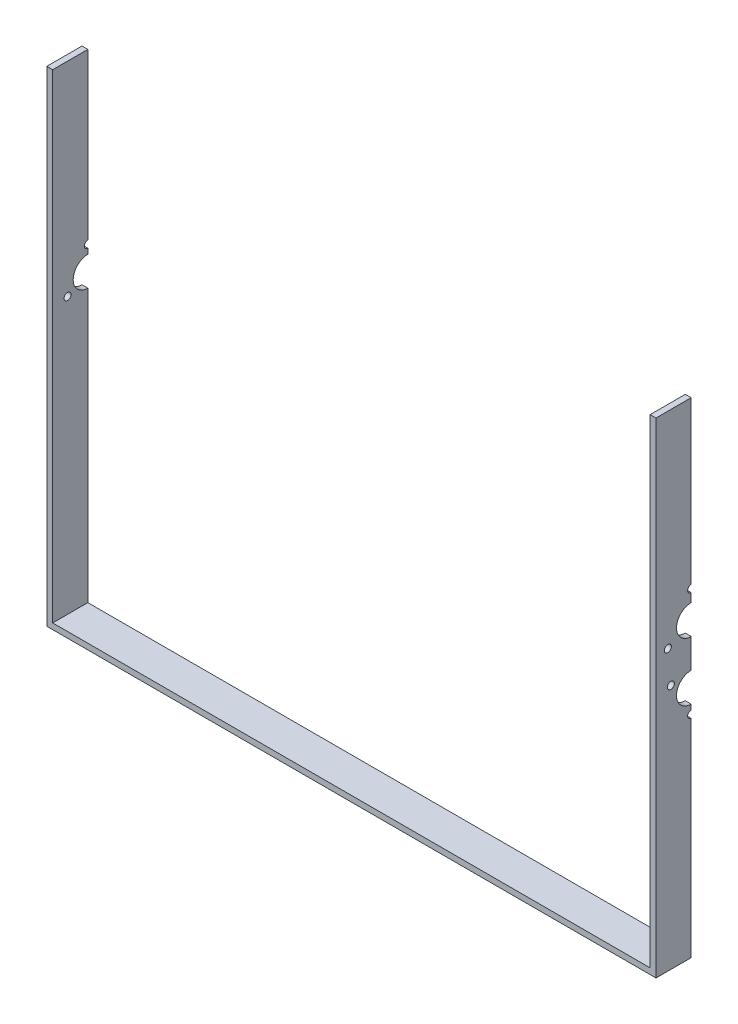
ISO-10303-21;
HEADER;
FILE_DESCRIPTION(('STEP AP214'),'2;1');
FILE_NAME('part.step','',(''),(''),'','','');
FILE_SCHEMA(('AUTOMOTIVE_DESIGN { 1 0 10303 214 1 1 1 1 }'));
ENDSEC;
DATA;
#1=APPLICATION_CONTEXT('core data for automotive mechanical design processes');
#2=APPLICATION_PROTOCOL_DEFINITION('international standard','automotive_design',2000,#1);
#3=PRODUCT_CONTEXT('',#1,'mechanical');
#4=PRODUCT('Part','Part','',(#3));
#5=PRODUCT_RELATED_PRODUCT_CATEGORY('part','',(#4));
#6=PRODUCT_DEFINITION_FORMATION('','',#4);
#7=PRODUCT_DEFINITION_CONTEXT('part definition',#1,'design');
#8=PRODUCT_DEFINITION('design','',#6,#7);
#9=PRODUCT_DEFINITION_SHAPE('','',#8);
#10=(LENGTH_UNIT() NAMED_UNIT(*) SI_UNIT(.MILLI.,.METRE.));
#11=(NAMED_UNIT(*) PLANE_ANGLE_UNIT() SI_UNIT($,.RADIAN.));
#12=(NAMED_UNIT(*) SI_UNIT($,.STERADIAN.) SOLID_ANGLE_UNIT());
#13=UNCERTAINTY_MEASURE_WITH_UNIT(LENGTH_MEASURE(1.E-05),#10,'distance_accuracy_value','');
#14=(GEOMETRIC_REPRESENTATION_CONTEXT(3) GLOBAL_UNCERTAINTY_ASSIGNED_CONTEXT((#13)) GLOBAL_UNIT_ASSIGNED_CONTEXT((#10,
#11,#12)) REPRESENTATION_CONTEXT('',''));
#15=CARTESIAN_POINT('',(0.,0.,0.));
#16=DIRECTION('',(0.,0.,1.));
#17=DIRECTION('',(1.,0.,0.));
#18=AXIS2_PLACEMENT_3D('',#15,#16,#17);
#19=CARTESIAN_POINT('',(0.,0.,0.));
#20=DIRECTION('',(0.,0.,-1.));
#21=DIRECTION('',(-1.,0.,0.));
#22=AXIS2_PLACEMENT_3D('',#19,#20,#21);
#23=PLANE('',#22);
#24=DIRECTION('',(1.,0.,0.));
#25=VECTOR('',#24,1.);
#26=CARTESIAN_POINT('',(246.514718625761,66.5,0.));
#27=LINE('',#26,#25);
#28=CARTESIAN_POINT('',(255.,66.5,0.));
#29=VERTEX_POINT('',#28);
#30=CARTESIAN_POINT('',(260.,66.5,0.));
#31=VERTEX_POINT('',#30);
#32=EDGE_CURVE('E171',#29,#31,#27,.T.);
#33=ORIENTED_EDGE('',*,*,#32,.F.);
#34=DIRECTION('',(0.,-1.,0.));
#35=VECTOR('',#34,1.);
#36=CARTESIAN_POINT('',(255.,-204.5,0.));
#37=LINE('',#36,#35);
#38=CARTESIAN_POINT('',(255.,204.5,0.));
#39=VERTEX_POINT('',#38);
#40=EDGE_CURVE('E182',#39,#29,#37,.T.);
#41=ORIENTED_EDGE('',*,*,#40,.F.);
#42=DIRECTION('',(1.,0.,0.));
#43=VECTOR('',#42,1.);
#44=CARTESIAN_POINT('',(255.,204.5,0.));
#45=LINE('',#44,#43);
#46=CARTESIAN_POINT('',(260.,204.5,0.));
#47=VERTEX_POINT('',#46);
#48=EDGE_CURVE('E207',#39,#47,#45,.T.);
#49=ORIENTED_EDGE('',*,*,#48,.T.);
#50=DIRECTION('',(0.,1.,0.));
#51=VECTOR('',#50,1.);
#52=CARTESIAN_POINT('',(260.,-204.5,0.));
#53=LINE('',#52,#51);
#54=EDGE_CURVE('E185',#47,#31,#53,.F.);
#55=ORIENTED_EDGE('',*,*,#54,.T.);
#56=EDGE_LOOP('',(#33,#41,#49,#55));
#57=FACE_BOUND('',#56,.T.);
#58=ADVANCED_FACE('F35',(#57),#23,.T.);
#59=DIRECTION('',(-1.,0.,0.));
#60=VECTOR('',#59,1.);
#61=CARTESIAN_POINT('',(-246.514718625761,57.5,0.));
#62=LINE('',#61,#60);
#63=CARTESIAN_POINT('',(-255.,57.5,0.));
#64=VERTEX_POINT('',#63);
#65=CARTESIAN_POINT('',(-260.,57.5,0.));
#66=VERTEX_POINT('',#65);
#67=EDGE_CURVE('E11',#64,#66,#62,.T.);
#68=ORIENTED_EDGE('',*,*,#67,.F.);
#69=DIRECTION('',(0.,1.,0.));
#70=VECTOR('',#69,1.);
#71=CARTESIAN_POINT('',(-255.,-204.5,0.));
#72=LINE('',#71,#70);
#73=CARTESIAN_POINT('',(-255.,53.,0.));
#74=VERTEX_POINT('',#73);
#75=EDGE_CURVE('E230',#74,#64,#72,.T.);
#76=ORIENTED_EDGE('',*,*,#75,.F.);
#77=DIRECTION('',(-1.,0.,0.));
#78=VECTOR('',#77,1.);
#79=CARTESIAN_POINT('',(260.001,53.,0.));
#80=LINE('',#79,#78);
#81=CARTESIAN_POINT('',(-260.,53.,0.));
#82=VERTEX_POINT('',#81);
#83=EDGE_CURVE('E260',#74,#82,#80,.T.);
#84=ORIENTED_EDGE('',*,*,#83,.T.);
#85=DIRECTION('',(0.,1.,0.));
#86=VECTOR('',#85,1.);
#87=CARTESIAN_POINT('',(-260.,-204.5,0.));
#88=LINE('',#87,#86);
#89=EDGE_CURVE('E222',#82,#66,#88,.T.);
#90=ORIENTED_EDGE('',*,*,#89,.T.);
#91=EDGE_LOOP('',(#68,#76,#84,#90));
#92=FACE_BOUND('',#91,.T.);
#93=ADVANCED_FACE('F343',(#92),#23,.T.);
#94=DIRECTION('',(1.,0.,0.));
#95=VECTOR('',#94,1.);
#96=CARTESIAN_POINT('',(246.514718625761,-26.5,0.));
#97=LINE('',#96,#95);
#98=CARTESIAN_POINT('',(255.,-26.5,0.));
#99=VERTEX_POINT('',#98);
#100=CARTESIAN_POINT('',(260.,-26.5,0.));
#101=VERTEX_POINT('',#100);
#102=EDGE_CURVE('E284',#99,#101,#97,.T.);
#103=ORIENTED_EDGE('',*,*,#102,.F.);
#104=CARTESIAN_POINT('',(255.,-22.,0.));
#105=VERTEX_POINT('',#104);
#106=EDGE_CURVE('E200',#105,#99,#37,.T.);
#107=ORIENTED_EDGE('',*,*,#106,.F.);
#108=DIRECTION('',(1.,0.,0.));
#109=VECTOR('',#108,1.);
#110=CARTESIAN_POINT('',(-260.001,-22.,0.));
#111=LINE('',#110,#109);
#112=CARTESIAN_POINT('',(260.,-22.,0.));
#113=VERTEX_POINT('',#112);
#114=EDGE_CURVE('E281',#105,#113,#111,.T.);
#115=ORIENTED_EDGE('',*,*,#114,.T.);
#116=EDGE_CURVE('E392',#113,#101,#53,.F.);
#117=ORIENTED_EDGE('',*,*,#116,.T.);
#118=EDGE_LOOP('',(#103,#107,#115,#117));
#119=FACE_BOUND('',#118,.T.);
#120=ADVANCED_FACE('F351',(#119),#23,.T.);
#121=DIRECTION('',(1.,0.,0.));
#122=VECTOR('',#121,1.);
#123=CARTESIAN_POINT('',(-260.001,2.99999999999998,0.));
#124=LINE('',#123,#122);
#125=CARTESIAN_POINT('',(260.,2.99999999999998,0.));
#126=VERTEX_POINT('',#125);
#127=CARTESIAN_POINT('',(255.,2.99999999999998,0.));
#128=VERTEX_POINT('',#127);
#129=EDGE_CURVE('E278',#126,#128,#124,.F.);
#130=ORIENTED_EDGE('',*,*,#129,.T.);
#131=CARTESIAN_POINT('',(255.,28.,0.));
#132=VERTEX_POINT('',#131);
#133=EDGE_CURVE('E194',#132,#128,#37,.T.);
#134=ORIENTED_EDGE('',*,*,#133,.F.);
#135=DIRECTION('',(1.,0.,0.));
#136=VECTOR('',#135,1.);
#137=CARTESIAN_POINT('',(-260.001,28.,0.));
#138=LINE('',#137,#136);
#139=CARTESIAN_POINT('',(260.,28.,0.));
#140=VERTEX_POINT('',#139);
#141=EDGE_CURVE('E271',#132,#140,#138,.T.);
#142=ORIENTED_EDGE('',*,*,#141,.T.);
#143=EDGE_CURVE('E213',#140,#126,#53,.F.);
#144=ORIENTED_EDGE('',*,*,#143,.T.);
#145=EDGE_LOOP('',(#130,#134,#142,#144));
#146=FACE_BOUND('',#145,.T.);
#147=ADVANCED_FACE('F381',(#146),#23,.T.);
#148=DIRECTION('',(1.,0.,0.));
#149=VECTOR('',#148,1.);
#150=CARTESIAN_POINT('',(246.514718625761,60.5,0.));
#151=LINE('',#150,#149);
#152=CARTESIAN_POINT('',(260.,60.5,0.));
#153=VERTEX_POINT('',#152);
#154=CARTESIAN_POINT('',(255.,60.5,0.));
#155=VERTEX_POINT('',#154);
#156=EDGE_CURVE('E50',#153,#155,#151,.F.);
#157=ORIENTED_EDGE('',*,*,#156,.F.);
#158=CARTESIAN_POINT('',(260.,53.,0.));
#159=VERTEX_POINT('',#158);
#160=EDGE_CURVE('E211',#153,#159,#53,.F.);
#161=ORIENTED_EDGE('',*,*,#160,.T.);
#162=DIRECTION('',(1.,0.,0.));
#163=VECTOR('',#162,1.);
#164=CARTESIAN_POINT('',(-260.001,53.,0.));
#165=LINE('',#164,#163);
#166=CARTESIAN_POINT('',(255.,53.,0.));
#167=VERTEX_POINT('',#166);
#168=EDGE_CURVE('E268',#159,#167,#165,.F.);
#169=ORIENTED_EDGE('',*,*,#168,.T.);
#170=EDGE_CURVE('E192',#155,#167,#37,.T.);
#171=ORIENTED_EDGE('',*,*,#170,.F.);
#172=EDGE_LOOP('',(#157,#161,#169,#171));
#173=FACE_BOUND('',#172,.T.);
#174=ADVANCED_FACE('F372',(#173),#23,.T.);
#175=DIRECTION('',(1.,0.,0.));
#176=VECTOR('',#175,1.);
#177=CARTESIAN_POINT('',(246.514718625761,-32.5,0.));
#178=LINE('',#177,#176);
#179=CARTESIAN_POINT('',(260.,-32.5,0.));
#180=VERTEX_POINT('',#179);
#181=CARTESIAN_POINT('',(255.,-32.5,0.));
#182=VERTEX_POINT('',#181);
#183=EDGE_CURVE('E286',#180,#182,#178,.F.);
#184=ORIENTED_EDGE('',*,*,#183,.F.);
#185=CARTESIAN_POINT('',(260.,-209.5,0.));
#186=VERTEX_POINT('',#185);
#187=EDGE_CURVE('E218',#180,#186,#53,.F.);
#188=ORIENTED_EDGE('',*,*,#187,.T.);
#189=DIRECTION('',(1.,0.,0.));
#190=VECTOR('',#189,1.);
#191=CARTESIAN_POINT('',(-255.,-209.5,0.));
#192=LINE('',#191,#190);
#193=CARTESIAN_POINT('',(-260.,-209.5,0.));
#194=VERTEX_POINT('',#193);
#195=EDGE_CURVE('E215',#186,#194,#192,.F.);
#196=ORIENTED_EDGE('',*,*,#195,.T.);
#197=CARTESIAN_POINT('',(-260.,28.,0.));
#198=VERTEX_POINT('',#197);
#199=EDGE_CURVE('E219',#194,#198,#88,.T.);
#200=ORIENTED_EDGE('',*,*,#199,.T.);
#201=DIRECTION('',(-1.,0.,0.));
#202=VECTOR('',#201,1.);
#203=CARTESIAN_POINT('',(260.001,28.,0.));
#204=LINE('',#203,#202);
#205=CARTESIAN_POINT('',(-255.,28.,0.));
#206=VERTEX_POINT('',#205);
#207=EDGE_CURVE('E257',#198,#206,#204,.F.);
#208=ORIENTED_EDGE('',*,*,#207,.T.);
#209=CARTESIAN_POINT('',(-255.,-204.5,0.));
#210=VERTEX_POINT('',#209);
#211=EDGE_CURVE('E227',#210,#206,#72,.T.);
#212=ORIENTED_EDGE('',*,*,#211,.F.);
#213=DIRECTION('',(-1.,0.,0.));
#214=VECTOR('',#213,1.);
#215=CARTESIAN_POINT('',(-255.,-204.5,0.));
#216=LINE('',#215,#214);
#217=CARTESIAN_POINT('',(255.,-204.5,0.));
#218=VERTEX_POINT('',#217);
#219=EDGE_CURVE('E191',#218,#210,#216,.T.);
#220=ORIENTED_EDGE('',*,*,#219,.F.);
#221=EDGE_CURVE('E197',#182,#218,#37,.T.);
#222=ORIENTED_EDGE('',*,*,#221,.F.);
#223=EDGE_LOOP('',(#184,#188,#196,#200,#208,#212,#220,#222));
#224=FACE_BOUND('',#223,.T.);
#225=ADVANCED_FACE('F359',(#224),#23,.T.);
#226=CARTESIAN_POINT('',(-255.,-204.5,30.));
#227=DIRECTION('',(-1.,0.,0.));
#228=DIRECTION('',(0.,0.,1.));
#229=AXIS2_PLACEMENT_3D('',#226,#227,#228);
#230=PLANE('',#229);
#231=CARTESIAN_POINT('',(-255.,30.5000000000004,17.3205080756896));
#232=DIRECTION('',(-1.,0.,0.));
#233=DIRECTION('',(0.,0.,1.));
#234=AXIS2_PLACEMENT_3D('',#231,#232,#233);
#235=CIRCLE('',#234,3.);
#236=CARTESIAN_POINT('',(-255.,30.5000000000004,20.3205080756896));
#237=VERTEX_POINT('',#236);
#238=EDGE_CURVE('E301',#237,#237,#235,.F.);
#239=ORIENTED_EDGE('',*,*,#238,.F.);
#240=EDGE_LOOP('',(#239));
#241=FACE_BOUND('',#240,.T.);
#242=ORIENTED_EDGE('',*,*,#75,.T.);
#243=CARTESIAN_POINT('',(-255.,60.5,0.));
#244=DIRECTION('',(-1.,0.,0.));
#245=DIRECTION('',(0.,0.,1.));
#246=AXIS2_PLACEMENT_3D('',#243,#244,#245);
#247=CIRCLE('',#246,3.);
#248=CARTESIAN_POINT('',(-255.,63.5,0.));
#249=VERTEX_POINT('',#248);
#250=EDGE_CURVE('E298',#249,#64,#247,.F.);
#251=ORIENTED_EDGE('',*,*,#250,.F.);
#252=CARTESIAN_POINT('',(-255.,204.5,0.));
#253=VERTEX_POINT('',#252);
#254=EDGE_CURVE('E231',#249,#253,#72,.T.);
#255=ORIENTED_EDGE('',*,*,#254,.T.);
#256=DIRECTION('',(0.,0.,-1.));
#257=VECTOR('',#256,1.);
#258=CARTESIAN_POINT('',(-255.,204.5,30.));
#259=LINE('',#258,#257);
#260=CARTESIAN_POINT('',(-255.,204.5,30.));
#261=VERTEX_POINT('',#260);
#262=EDGE_CURVE('E573',#261,#253,#259,.T.);
#263=ORIENTED_EDGE('',*,*,#262,.F.);
#264=DIRECTION('',(0.,1.,0.));
#265=VECTOR('',#264,1.);
#266=CARTESIAN_POINT('',(-255.,-204.5,30.));
#267=LINE('',#266,#265);
#268=CARTESIAN_POINT('',(-255.,-204.5,30.));
#269=VERTEX_POINT('',#268);
#270=EDGE_CURVE('E195',#269,#261,#267,.T.);
#271=ORIENTED_EDGE('',*,*,#270,.F.);
#272=DIRECTION('',(0.,0.,-1.));
#273=VECTOR('',#272,1.);
#274=CARTESIAN_POINT('',(-255.,-204.5,30.));
#275=LINE('',#274,#273);
#276=EDGE_CURVE('E234',#269,#210,#275,.T.);
#277=ORIENTED_EDGE('',*,*,#276,.T.);
#278=ORIENTED_EDGE('',*,*,#211,.T.);
#279=CARTESIAN_POINT('',(-255.,40.5,0.));
#280=DIRECTION('',(-1.,0.,0.));
#281=DIRECTION('',(0.,0.,1.));
#282=AXIS2_PLACEMENT_3D('',#279,#280,#281);
#283=CIRCLE('',#282,12.5);
#284=EDGE_CURVE('E253',#74,#206,#283,.F.);
#285=ORIENTED_EDGE('',*,*,#284,.F.);
#286=EDGE_LOOP('',(#242,#251,#255,#263,#271,#277,#278,#285));
#287=FACE_BOUND('',#286,.T.);
#288=ADVANCED_FACE('F37',(#241,#287),#230,.F.);
#289=CARTESIAN_POINT('',(-260.,204.5,30.));
#290=DIRECTION('',(0.,1.,0.));
#291=DIRECTION('',(0.,0.,1.));
#292=AXIS2_PLACEMENT_3D('',#289,#290,#291);
#293=PLANE('',#292);
#294=DIRECTION('',(1.,0.,0.));
#295=VECTOR('',#294,1.);
#296=CARTESIAN_POINT('',(-260.,204.5,0.));
#297=LINE('',#296,#295);
#298=CARTESIAN_POINT('',(-260.,204.5,0.));
#299=VERTEX_POINT('',#298);
#300=EDGE_CURVE('E224',#299,#253,#297,.T.);
#301=ORIENTED_EDGE('',*,*,#300,.F.);
#302=DIRECTION('',(0.,0.,-1.));
#303=VECTOR('',#302,1.);
#304=CARTESIAN_POINT('',(-260.,204.5,30.));
#305=LINE('',#304,#303);
#306=CARTESIAN_POINT('',(-260.,204.5,30.));
#307=VERTEX_POINT('',#306);
#308=EDGE_CURVE('E570',#307,#299,#305,.T.);
#309=ORIENTED_EDGE('',*,*,#308,.F.);
#310=DIRECTION('',(1.,0.,0.));
#311=VECTOR('',#310,1.);
#312=CARTESIAN_POINT('',(-260.,204.5,30.));
#313=LINE('',#312,#311);
#314=EDGE_CURVE('E249',#307,#261,#313,.T.);
#315=ORIENTED_EDGE('',*,*,#314,.T.);
#316=ORIENTED_EDGE('',*,*,#262,.T.);
#317=EDGE_LOOP('',(#301,#309,#315,#316));
#318=FACE_BOUND('',#317,.T.);
#319=ADVANCED_FACE('F379',(#318),#293,.T.);
#320=CARTESIAN_POINT('',(-260.,-204.5,30.));
#321=DIRECTION('',(-1.,0.,0.));
#322=DIRECTION('',(0.,0.,1.));
#323=AXIS2_PLACEMENT_3D('',#320,#321,#322);
#324=PLANE('',#323);
#325=CARTESIAN_POINT('',(-260.,30.5000000000004,17.3205080756896));
#326=DIRECTION('',(-1.,0.,0.));
#327=DIRECTION('',(0.,0.,1.));
#328=AXIS2_PLACEMENT_3D('',#325,#326,#327);
#329=CIRCLE('',#328,3.);
#330=CARTESIAN_POINT('',(-260.,30.5000000000004,20.3205080756896));
#331=VERTEX_POINT('',#330);
#332=EDGE_CURVE('E186',#331,#331,#329,.T.);
#333=ORIENTED_EDGE('',*,*,#332,.F.);
#334=EDGE_LOOP('',(#333));
#335=FACE_BOUND('',#334,.T.);
#336=CARTESIAN_POINT('',(-260.,60.5,0.));
#337=DIRECTION('',(-1.,0.,0.));
#338=DIRECTION('',(0.,0.,1.));
#339=AXIS2_PLACEMENT_3D('',#336,#337,#338);
#340=CIRCLE('',#339,3.);
#341=CARTESIAN_POINT('',(-260.,63.5,0.));
#342=VERTEX_POINT('',#341);
#343=EDGE_CURVE('E57',#66,#342,#340,.T.);
#344=ORIENTED_EDGE('',*,*,#343,.F.);
#345=ORIENTED_EDGE('',*,*,#89,.F.);
#346=CARTESIAN_POINT('',(-260.,40.5,0.));
#347=DIRECTION('',(-1.,0.,0.));
#348=DIRECTION('',(0.,0.,1.));
#349=AXIS2_PLACEMENT_3D('',#346,#347,#348);
#350=CIRCLE('',#349,12.5);
#351=EDGE_CURVE('E255',#198,#82,#350,.T.);
#352=ORIENTED_EDGE('',*,*,#351,.F.);
#353=ORIENTED_EDGE('',*,*,#199,.F.);
#354=DIRECTION('',(0.,0.,-1.));
#355=VECTOR('',#354,1.);
#356=CARTESIAN_POINT('',(-260.,-209.5,30.));
#357=LINE('',#356,#355);
#358=CARTESIAN_POINT('',(-260.,-209.5,30.));
#359=VERTEX_POINT('',#358);
#360=EDGE_CURVE('E574',#359,#194,#357,.T.);
#361=ORIENTED_EDGE('',*,*,#360,.F.);
#362=DIRECTION('',(0.,1.,0.));
#363=VECTOR('',#362,1.);
#364=CARTESIAN_POINT('',(-260.,-204.5,30.));
#365=LINE('',#364,#363);
#366=EDGE_CURVE('E246',#359,#307,#365,.T.);
#367=ORIENTED_EDGE('',*,*,#366,.T.);
#368=ORIENTED_EDGE('',*,*,#308,.T.);
#369=EDGE_CURVE('E223',#342,#299,#88,.T.);
#370=ORIENTED_EDGE('',*,*,#369,.F.);
#371=EDGE_LOOP('',(#344,#345,#352,#353,#361,#367,#368,#370));
#372=FACE_BOUND('',#371,.T.);
#373=ADVANCED_FACE('F435',(#335,#372),#324,.T.);
#374=CARTESIAN_POINT('',(-255.,-209.5,30.));
#375=DIRECTION('',(0.,-1.,0.));
#376=DIRECTION('',(0.,0.,-1.));
#377=AXIS2_PLACEMENT_3D('',#374,#375,#376);
#378=PLANE('',#377);
#379=ORIENTED_EDGE('',*,*,#195,.F.);
#380=DIRECTION('',(0.,0.,-1.));
#381=VECTOR('',#380,1.);
#382=CARTESIAN_POINT('',(260.,-209.5,30.));
#383=LINE('',#382,#381);
#384=CARTESIAN_POINT('',(260.,-209.5,30.));
#385=VERTEX_POINT('',#384);
#386=EDGE_CURVE('E390',#385,#186,#383,.T.);
#387=ORIENTED_EDGE('',*,*,#386,.F.);
#388=DIRECTION('',(1.,0.,0.));
#389=VECTOR('',#388,1.);
#390=CARTESIAN_POINT('',(-255.,-209.5,30.));
#391=LINE('',#390,#389);
#392=EDGE_CURVE('E243',#385,#359,#391,.F.);
#393=ORIENTED_EDGE('',*,*,#392,.T.);
#394=ORIENTED_EDGE('',*,*,#360,.T.);
#395=EDGE_LOOP('',(#379,#387,#393,#394));
#396=FACE_BOUND('',#395,.T.);
#397=ADVANCED_FACE('F321',(#396),#378,.T.);
#398=CARTESIAN_POINT('',(260.,-204.5,30.));
#399=DIRECTION('',(1.,0.,0.));
#400=DIRECTION('',(0.,0.,-1.));
#401=AXIS2_PLACEMENT_3D('',#398,#399,#400);
#402=PLANE('',#401);
#403=CARTESIAN_POINT('',(260.,28.9999999999995,19.9185842870412));
#404=DIRECTION('',(1.,0.,0.));
#405=DIRECTION('',(0.,1.,0.));
#406=AXIS2_PLACEMENT_3D('',#403,#404,#405);
#407=CIRCLE('',#406,3.);
#408=CARTESIAN_POINT('',(260.,31.9999999999995,19.9185842870412));
#409=VERTEX_POINT('',#408);
#410=EDGE_CURVE('E311',#409,#409,#407,.T.);
#411=ORIENTED_EDGE('',*,*,#410,.F.);
#412=EDGE_LOOP('',(#411));
#413=FACE_BOUND('',#412,.T.);
#414=CARTESIAN_POINT('',(260.,63.5,0.));
#415=DIRECTION('',(1.,0.,0.));
#416=DIRECTION('',(0.,1.,0.));
#417=AXIS2_PLACEMENT_3D('',#414,#415,#416);
#418=CIRCLE('',#417,3.);
#419=EDGE_CURVE('E176',#31,#153,#418,.T.);
#420=ORIENTED_EDGE('',*,*,#419,.F.);
#421=ORIENTED_EDGE('',*,*,#54,.F.);
#422=DIRECTION('',(0.,0.,-1.));
#423=VECTOR('',#422,1.);
#424=CARTESIAN_POINT('',(260.,204.5,30.));
#425=LINE('',#424,#423);
#426=CARTESIAN_POINT('',(260.,204.5,30.));
#427=VERTEX_POINT('',#426);
#428=EDGE_CURVE('E584',#427,#47,#425,.T.);
#429=ORIENTED_EDGE('',*,*,#428,.F.);
#430=DIRECTION('',(0.,1.,0.));
#431=VECTOR('',#430,1.);
#432=CARTESIAN_POINT('',(260.,-204.5,30.));
#433=LINE('',#432,#431);
#434=EDGE_CURVE('E240',#427,#385,#433,.F.);
#435=ORIENTED_EDGE('',*,*,#434,.T.);
#436=ORIENTED_EDGE('',*,*,#386,.T.);
#437=ORIENTED_EDGE('',*,*,#187,.F.);
#438=CARTESIAN_POINT('',(260.,-29.5,0.));
#439=DIRECTION('',(1.,0.,0.));
#440=DIRECTION('',(0.,0.,-1.));
#441=AXIS2_PLACEMENT_3D('',#438,#439,#440);
#442=CIRCLE('',#441,3.);
#443=EDGE_CURVE('E290',#101,#180,#442,.T.);
#444=ORIENTED_EDGE('',*,*,#443,.F.);
#445=ORIENTED_EDGE('',*,*,#116,.F.);
#446=CARTESIAN_POINT('',(260.,-9.50000000000002,0.));
#447=DIRECTION('',(1.,0.,0.));
#448=DIRECTION('',(0.,0.,-1.));
#449=AXIS2_PLACEMENT_3D('',#446,#447,#448);
#450=CIRCLE('',#449,12.5);
#451=EDGE_CURVE('E276',#126,#113,#450,.T.);
#452=ORIENTED_EDGE('',*,*,#451,.F.);
#453=ORIENTED_EDGE('',*,*,#143,.F.);
#454=CARTESIAN_POINT('',(260.,40.5,0.));
#455=DIRECTION('',(1.,0.,0.));
#456=DIRECTION('',(0.,0.,-1.));
#457=AXIS2_PLACEMENT_3D('',#454,#455,#456);
#458=CIRCLE('',#457,12.5);
#459=EDGE_CURVE('E266',#159,#140,#458,.T.);
#460=ORIENTED_EDGE('',*,*,#459,.F.);
#461=ORIENTED_EDGE('',*,*,#160,.F.);
#462=EDGE_LOOP('',(#420,#421,#429,#435,#436,#437,#444,#445,#452,#453,#460,#461));
#463=FACE_BOUND('',#462,.T.);
#464=CARTESIAN_POINT('',(260.,0.500000000000063,17.3205080756887));
#465=DIRECTION('',(1.,0.,0.));
#466=DIRECTION('',(0.,0.,-1.));
#467=AXIS2_PLACEMENT_3D('',#464,#465,#466);
#468=CIRCLE('',#467,3.);
#469=CARTESIAN_POINT('',(260.,0.500000000000063,14.3205080756887));
#470=VERTEX_POINT('',#469);
#471=EDGE_CURVE('E295',#470,#470,#468,.T.);
#472=ORIENTED_EDGE('',*,*,#471,.F.);
#473=EDGE_LOOP('',(#472));
#474=FACE_BOUND('',#473,.T.);
#475=ADVANCED_FACE('F317',(#413,#463,#474),#402,.T.);
#476=CARTESIAN_POINT('',(255.,204.5,30.));
#477=DIRECTION('',(0.,1.,0.));
#478=DIRECTION('',(0.,0.,1.));
#479=AXIS2_PLACEMENT_3D('',#476,#477,#478);
#480=PLANE('',#479);
#481=ORIENTED_EDGE('',*,*,#48,.F.);
#482=DIRECTION('',(0.,0.,-1.));
#483=VECTOR('',#482,1.);
#484=CARTESIAN_POINT('',(255.,204.5,30.));
#485=LINE('',#484,#483);
#486=CARTESIAN_POINT('',(255.,204.5,30.));
#487=VERTEX_POINT('',#486);
#488=EDGE_CURVE('E190',#487,#39,#485,.T.);
#489=ORIENTED_EDGE('',*,*,#488,.F.);
#490=DIRECTION('',(1.,0.,0.));
#491=VECTOR('',#490,1.);
#492=CARTESIAN_POINT('',(255.,204.5,30.));
#493=LINE('',#492,#491);
#494=EDGE_CURVE('E237',#487,#427,#493,.T.);
#495=ORIENTED_EDGE('',*,*,#494,.T.);
#496=ORIENTED_EDGE('',*,*,#428,.T.);
#497=EDGE_LOOP('',(#481,#489,#495,#496));
#498=FACE_BOUND('',#497,.T.);
#499=ADVANCED_FACE('F320',(#498),#480,.T.);
#500=CARTESIAN_POINT('',(255.,-204.5,30.));
#501=DIRECTION('',(1.,0.,0.));
#502=DIRECTION('',(0.,0.,-1.));
#503=AXIS2_PLACEMENT_3D('',#500,#501,#502);
#504=PLANE('',#503);
#505=CARTESIAN_POINT('',(255.,28.9999999999995,19.9185842870412));
#506=DIRECTION('',(1.,0.,0.));
#507=DIRECTION('',(0.,0.,-1.));
#508=AXIS2_PLACEMENT_3D('',#505,#506,#507);
#509=CIRCLE('',#508,3.);
#510=CARTESIAN_POINT('',(255.,28.9999999999995,16.9185842870412));
#511=VERTEX_POINT('',#510);
#512=EDGE_CURVE('E308',#511,#511,#509,.F.);
#513=ORIENTED_EDGE('',*,*,#512,.F.);
#514=EDGE_LOOP('',(#513));
#515=FACE_BOUND('',#514,.T.);
#516=CARTESIAN_POINT('',(255.,0.500000000000063,17.3205080756887));
#517=DIRECTION('',(1.,0.,0.));
#518=DIRECTION('',(0.,0.,-1.));
#519=AXIS2_PLACEMENT_3D('',#516,#517,#518);
#520=CIRCLE('',#519,3.);
#521=CARTESIAN_POINT('',(255.,0.500000000000063,14.3205080756887));
#522=VERTEX_POINT('',#521);
#523=EDGE_CURVE('E292',#522,#522,#520,.F.);
#524=ORIENTED_EDGE('',*,*,#523,.F.);
#525=EDGE_LOOP('',(#524));
#526=FACE_BOUND('',#525,.T.);
#527=ORIENTED_EDGE('',*,*,#40,.T.);
#528=CARTESIAN_POINT('',(255.,63.5,0.));
#529=DIRECTION('',(1.,0.,0.));
#530=DIRECTION('',(0.,0.,-1.));
#531=AXIS2_PLACEMENT_3D('',#528,#529,#530);
#532=CIRCLE('',#531,3.);
#533=EDGE_CURVE('E168',#155,#29,#532,.F.);
#534=ORIENTED_EDGE('',*,*,#533,.F.);
#535=ORIENTED_EDGE('',*,*,#170,.T.);
#536=CARTESIAN_POINT('',(255.,40.5,0.));
#537=DIRECTION('',(1.,0.,0.));
#538=DIRECTION('',(0.,0.,-1.));
#539=AXIS2_PLACEMENT_3D('',#536,#537,#538);
#540=CIRCLE('',#539,12.5);
#541=EDGE_CURVE('E263',#132,#167,#540,.F.);
#542=ORIENTED_EDGE('',*,*,#541,.F.);
#543=ORIENTED_EDGE('',*,*,#133,.T.);
#544=CARTESIAN_POINT('',(255.,-9.50000000000002,0.));
#545=DIRECTION('',(1.,0.,0.));
#546=DIRECTION('',(0.,0.,-1.));
#547=AXIS2_PLACEMENT_3D('',#544,#545,#546);
#548=CIRCLE('',#547,12.5);
#549=EDGE_CURVE('E274',#105,#128,#548,.F.);
#550=ORIENTED_EDGE('',*,*,#549,.F.);
#551=ORIENTED_EDGE('',*,*,#106,.T.);
#552=CARTESIAN_POINT('',(255.,-29.5,0.));
#553=DIRECTION('',(1.,0.,0.));
#554=DIRECTION('',(0.,0.,-1.));
#555=AXIS2_PLACEMENT_3D('',#552,#553,#554);
#556=CIRCLE('',#555,3.);
#557=EDGE_CURVE('E288',#182,#99,#556,.F.);
#558=ORIENTED_EDGE('',*,*,#557,.F.);
#559=ORIENTED_EDGE('',*,*,#221,.T.);
#560=DIRECTION('',(0.,0.,-1.));
#561=VECTOR('',#560,1.);
#562=CARTESIAN_POINT('',(255.,-204.5,30.));
#563=LINE('',#562,#561);
#564=CARTESIAN_POINT('',(255.,-204.5,30.));
#565=VERTEX_POINT('',#564);
#566=EDGE_CURVE('E587',#565,#218,#563,.T.);
#567=ORIENTED_EDGE('',*,*,#566,.F.);
#568=DIRECTION('',(0.,-1.,0.));
#569=VECTOR('',#568,1.);
#570=CARTESIAN_POINT('',(255.,-204.5,30.));
#571=LINE('',#570,#569);
#572=EDGE_CURVE('E235',#487,#565,#571,.T.);
#573=ORIENTED_EDGE('',*,*,#572,.F.);
#574=ORIENTED_EDGE('',*,*,#488,.T.);
#575=EDGE_LOOP('',(#527,#534,#535,#542,#543,#550,#551,#558,#559,#567,#573,#574));
#576=FACE_BOUND('',#575,.T.);
#577=ADVANCED_FACE('F188',(#515,#526,#576),#504,.F.);
#578=CARTESIAN_POINT('',(-255.,-204.5,30.));
#579=DIRECTION('',(0.,-1.,0.));
#580=DIRECTION('',(0.,0.,-1.));
#581=AXIS2_PLACEMENT_3D('',#578,#579,#580);
#582=PLANE('',#581);
#583=ORIENTED_EDGE('',*,*,#219,.T.);
#584=ORIENTED_EDGE('',*,*,#276,.F.);
#585=DIRECTION('',(-1.,0.,0.));
#586=VECTOR('',#585,1.);
#587=CARTESIAN_POINT('',(-255.,-204.5,30.));
#588=LINE('',#587,#586);
#589=EDGE_CURVE('E232',#565,#269,#588,.T.);
#590=ORIENTED_EDGE('',*,*,#589,.F.);
#591=ORIENTED_EDGE('',*,*,#566,.T.);
#592=EDGE_LOOP('',(#583,#584,#590,#591));
#593=FACE_BOUND('',#592,.T.);
#594=ADVANCED_FACE('F369',(#593),#582,.F.);
#595=CARTESIAN_POINT('',(0.,0.,30.));
#596=DIRECTION('',(0.,0.,-1.));
#597=DIRECTION('',(-1.,0.,0.));
#598=AXIS2_PLACEMENT_3D('',#595,#596,#597);
#599=PLANE('',#598);
#600=ORIENTED_EDGE('',*,*,#270,.T.);
#601=ORIENTED_EDGE('',*,*,#314,.F.);
#602=ORIENTED_EDGE('',*,*,#366,.F.);
#603=ORIENTED_EDGE('',*,*,#392,.F.);
#604=ORIENTED_EDGE('',*,*,#434,.F.);
#605=ORIENTED_EDGE('',*,*,#494,.F.);
#606=ORIENTED_EDGE('',*,*,#572,.T.);
#607=ORIENTED_EDGE('',*,*,#589,.T.);
#608=EDGE_LOOP('',(#600,#601,#602,#603,#604,#605,#606,#607));
#609=FACE_BOUND('',#608,.T.);
#610=ADVANCED_FACE('F357',(#609),#599,.F.);
#611=DIRECTION('',(-1.,0.,0.));
#612=VECTOR('',#611,1.);
#613=CARTESIAN_POINT('',(-246.514718625761,63.5,0.));
#614=LINE('',#613,#612);
#615=EDGE_CURVE('E43',#342,#249,#614,.F.);
#616=ORIENTED_EDGE('',*,*,#615,.F.);
#617=ORIENTED_EDGE('',*,*,#369,.T.);
#618=ORIENTED_EDGE('',*,*,#300,.T.);
#619=ORIENTED_EDGE('',*,*,#254,.F.);
#620=EDGE_LOOP('',(#616,#617,#618,#619));
#621=FACE_BOUND('',#620,.T.);
#622=ADVANCED_FACE('F345',(#621),#23,.T.);
#623=CARTESIAN_POINT('',(260.001,40.5,0.));
#624=DIRECTION('',(-1.,0.,0.));
#625=DIRECTION('',(0.,0.,1.));
#626=AXIS2_PLACEMENT_3D('',#623,#624,#625);
#627=CYLINDRICAL_SURFACE('',#626,12.5);
#628=ORIENTED_EDGE('',*,*,#351,.T.);
#629=ORIENTED_EDGE('',*,*,#83,.F.);
#630=ORIENTED_EDGE('',*,*,#284,.T.);
#631=ORIENTED_EDGE('',*,*,#207,.F.);
#632=EDGE_LOOP('',(#628,#629,#630,#631));
#633=FACE_BOUND('',#632,.T.);
#634=ADVANCED_FACE('F356',(#633),#627,.F.);
#635=CARTESIAN_POINT('',(-260.001,40.5,0.));
#636=DIRECTION('',(1.,0.,0.));
#637=DIRECTION('',(0.,0.,-1.));
#638=AXIS2_PLACEMENT_3D('',#635,#636,#637);
#639=CYLINDRICAL_SURFACE('',#638,12.5);
#640=ORIENTED_EDGE('',*,*,#459,.T.);
#641=ORIENTED_EDGE('',*,*,#141,.F.);
#642=ORIENTED_EDGE('',*,*,#541,.T.);
#643=ORIENTED_EDGE('',*,*,#168,.F.);
#644=EDGE_LOOP('',(#640,#641,#642,#643));
#645=FACE_BOUND('',#644,.T.);
#646=ADVANCED_FACE('F365',(#645),#639,.F.);
#647=CARTESIAN_POINT('',(-260.001,-9.50000000000002,0.));
#648=DIRECTION('',(1.,0.,0.));
#649=DIRECTION('',(0.,0.,-1.));
#650=AXIS2_PLACEMENT_3D('',#647,#648,#649);
#651=CYLINDRICAL_SURFACE('',#650,12.5);
#652=ORIENTED_EDGE('',*,*,#451,.T.);
#653=ORIENTED_EDGE('',*,*,#114,.F.);
#654=ORIENTED_EDGE('',*,*,#549,.T.);
#655=ORIENTED_EDGE('',*,*,#129,.F.);
#656=EDGE_LOOP('',(#652,#653,#654,#655));
#657=FACE_BOUND('',#656,.T.);
#658=ADVANCED_FACE('F339',(#657),#651,.F.);
#659=CARTESIAN_POINT('',(246.514718625761,-29.5,0.));
#660=DIRECTION('',(1.,0.,0.));
#661=DIRECTION('',(0.,0.,-1.));
#662=AXIS2_PLACEMENT_3D('',#659,#660,#661);
#663=CYLINDRICAL_SURFACE('',#662,3.);
#664=ORIENTED_EDGE('',*,*,#102,.T.);
#665=ORIENTED_EDGE('',*,*,#443,.T.);
#666=ORIENTED_EDGE('',*,*,#183,.T.);
#667=ORIENTED_EDGE('',*,*,#557,.T.);
#668=EDGE_LOOP('',(#664,#665,#666,#667));
#669=FACE_BOUND('',#668,.T.);
#670=ADVANCED_FACE('F330',(#669),#663,.F.);
#671=CARTESIAN_POINT('',(246.514718625761,0.500000000000063,17.3205080756887));
#672=DIRECTION('',(1.,0.,0.));
#673=DIRECTION('',(0.,0.,-1.));
#674=AXIS2_PLACEMENT_3D('',#671,#672,#673);
#675=CYLINDRICAL_SURFACE('',#674,3.);
#676=ORIENTED_EDGE('',*,*,#523,.T.);
#677=EDGE_LOOP('',(#676));
#678=FACE_BOUND('',#677,.T.);
#679=ORIENTED_EDGE('',*,*,#471,.T.);
#680=EDGE_LOOP('',(#679));
#681=FACE_BOUND('',#680,.T.);
#682=ADVANCED_FACE('F327',(#678,#681),#675,.F.);
#683=CARTESIAN_POINT('',(-246.514718625761,60.5,0.));
#684=DIRECTION('',(-1.,0.,0.));
#685=DIRECTION('',(0.,0.,1.));
#686=AXIS2_PLACEMENT_3D('',#683,#684,#685);
#687=CYLINDRICAL_SURFACE('',#686,3.);
#688=ORIENTED_EDGE('',*,*,#67,.T.);
#689=ORIENTED_EDGE('',*,*,#343,.T.);
#690=ORIENTED_EDGE('',*,*,#615,.T.);
#691=ORIENTED_EDGE('',*,*,#250,.T.);
#692=EDGE_LOOP('',(#688,#689,#690,#691));
#693=FACE_BOUND('',#692,.T.);
#694=ADVANCED_FACE('F329',(#693),#687,.F.);
#695=CARTESIAN_POINT('',(-246.514718625761,30.5000000000004,17.3205080756896));
#696=DIRECTION('',(-1.,0.,0.));
#697=DIRECTION('',(0.,0.,1.));
#698=AXIS2_PLACEMENT_3D('',#695,#696,#697);
#699=CYLINDRICAL_SURFACE('',#698,3.);
#700=ORIENTED_EDGE('',*,*,#238,.T.);
#701=EDGE_LOOP('',(#700));
#702=FACE_BOUND('',#701,.T.);
#703=ORIENTED_EDGE('',*,*,#332,.T.);
#704=EDGE_LOOP('',(#703));
#705=FACE_BOUND('',#704,.T.);
#706=ADVANCED_FACE('F337',(#702,#705),#699,.F.);
#707=CARTESIAN_POINT('',(246.514718625761,63.5,0.));
#708=DIRECTION('',(1.,0.,0.));
#709=DIRECTION('',(0.,1.,0.));
#710=AXIS2_PLACEMENT_3D('',#707,#708,#709);
#711=CYLINDRICAL_SURFACE('',#710,3.);
#712=ORIENTED_EDGE('',*,*,#32,.T.);
#713=ORIENTED_EDGE('',*,*,#419,.T.);
#714=ORIENTED_EDGE('',*,*,#156,.T.);
#715=ORIENTED_EDGE('',*,*,#533,.T.);
#716=EDGE_LOOP('',(#712,#713,#714,#715));
#717=FACE_BOUND('',#716,.T.);
#718=ADVANCED_FACE('F170',(#717),#711,.F.);
#719=CARTESIAN_POINT('',(246.514718625761,28.9999999999995,19.9185842870412));
#720=DIRECTION('',(1.,0.,0.));
#721=DIRECTION('',(0.,1.,0.));
#722=AXIS2_PLACEMENT_3D('',#719,#720,#721);
#723=CYLINDRICAL_SURFACE('',#722,3.);
#724=ORIENTED_EDGE('',*,*,#512,.T.);
#725=EDGE_LOOP('',(#724));
#726=FACE_BOUND('',#725,.T.);
#727=ORIENTED_EDGE('',*,*,#410,.T.);
#728=EDGE_LOOP('',(#727));
#729=FACE_BOUND('',#728,.T.);
#730=ADVANCED_FACE('F315',(#726,#729),#723,.F.);
#731=CLOSED_SHELL('',(#58,#93,#120,#147,#174,#225,#288,#319,#373,#397,#475,#499,#577,#594,#610,
#622,#634,#646,#658,#670,#682,#694,#706,#718,#730));
#732=MANIFOLD_SOLID_BREP('B2',#731);
#733=ADVANCED_BREP_SHAPE_REPRESENTATION('',(#18,#732),#14);
#734=SHAPE_DEFINITION_REPRESENTATION(#9,#733);
ENDSEC;
END-ISO-10303-21;
